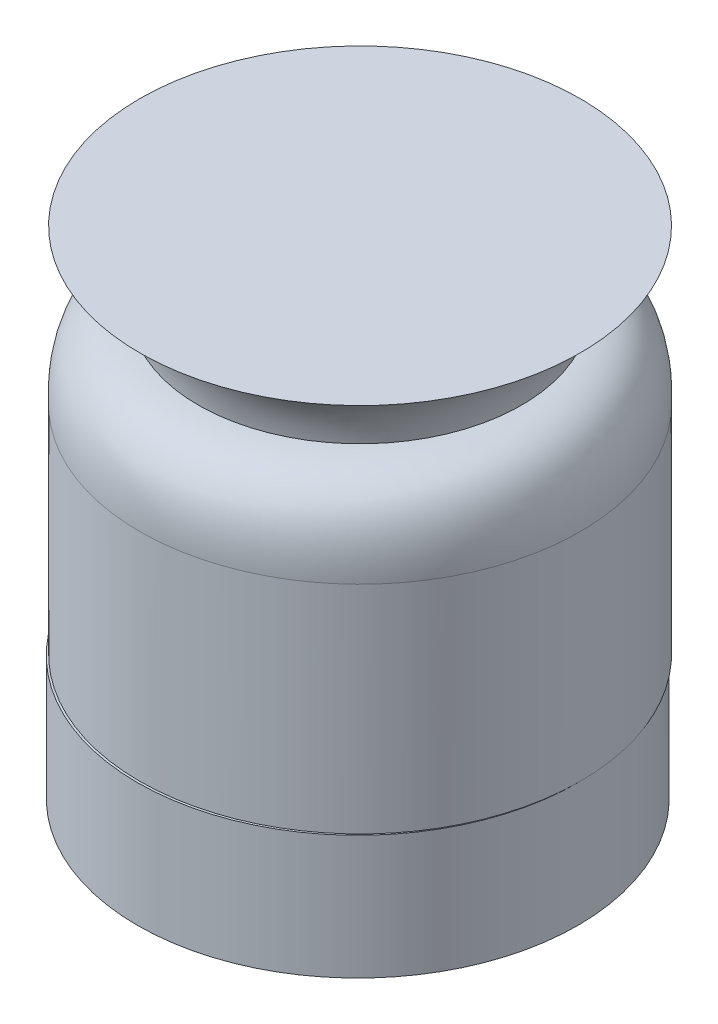
ISO-10303-21;
HEADER;
FILE_DESCRIPTION(('STEP AP214'),'2;1');
FILE_NAME('part.step','',(''),(''),'','','');
FILE_SCHEMA(('AUTOMOTIVE_DESIGN { 1 0 10303 214 1 1 1 1 }'));
ENDSEC;
DATA;
#1=APPLICATION_CONTEXT('core data for automotive mechanical design processes');
#2=APPLICATION_PROTOCOL_DEFINITION('international standard','automotive_design',2000,#1);
#3=PRODUCT_CONTEXT('',#1,'mechanical');
#4=PRODUCT('Part','Part','',(#3));
#5=PRODUCT_RELATED_PRODUCT_CATEGORY('part','',(#4));
#6=PRODUCT_DEFINITION_FORMATION('','',#4);
#7=PRODUCT_DEFINITION_CONTEXT('part definition',#1,'design');
#8=PRODUCT_DEFINITION('design','',#6,#7);
#9=PRODUCT_DEFINITION_SHAPE('','',#8);
#10=(LENGTH_UNIT() NAMED_UNIT(*) SI_UNIT(.MILLI.,.METRE.));
#11=(NAMED_UNIT(*) PLANE_ANGLE_UNIT() SI_UNIT($,.RADIAN.));
#12=(NAMED_UNIT(*) SI_UNIT($,.STERADIAN.) SOLID_ANGLE_UNIT());
#13=UNCERTAINTY_MEASURE_WITH_UNIT(LENGTH_MEASURE(1.E-05),#10,'distance_accuracy_value','');
#14=(GEOMETRIC_REPRESENTATION_CONTEXT(3) GLOBAL_UNCERTAINTY_ASSIGNED_CONTEXT((#13)) GLOBAL_UNIT_ASSIGNED_CONTEXT((#10,
#11,#12)) REPRESENTATION_CONTEXT('',''));
#15=CARTESIAN_POINT('',(0.,0.,0.));
#16=DIRECTION('',(0.,0.,1.));
#17=DIRECTION('',(1.,0.,0.));
#18=AXIS2_PLACEMENT_3D('',#15,#16,#17);
#19=CARTESIAN_POINT('',(-82.935,10.795,1.90500000000002));
#20=DIRECTION('',(0.,1.,0.));
#21=DIRECTION('',(0.,0.,1.));
#22=AXIS2_PLACEMENT_3D('',#19,#20,#21);
#23=PLANE('',#22);
#24=CARTESIAN_POINT('',(-37.975,10.7949999999999,-47.5));
#25=DIRECTION('',(0.,1.,0.));
#26=DIRECTION('',(-1.,0.,0.));
#27=AXIS2_PLACEMENT_3D('',#24,#25,#26);
#28=CIRCLE('',#27,47.5);
#29=CARTESIAN_POINT('',(-85.4743526520651,10.7949999999999,-47.2520128334827));
#30=VERTEX_POINT('',#29);
#31=CARTESIAN_POINT('',(9.52435265206508,10.7949999999999,-47.2520128334841));
#32=VERTEX_POINT('',#31);
#33=EDGE_CURVE('E76',#30,#32,#28,.T.);
#34=ORIENTED_EDGE('',*,*,#33,.F.);
#35=CARTESIAN_POINT('',(-37.975,10.7949999999999,-47.0040256669681));
#36=DIRECTION('',(0.,1.,0.));
#37=DIRECTION('',(0.,0.,1.));
#38=AXIS2_PLACEMENT_3D('',#35,#36,#37);
#39=CIRCLE('',#38,47.5);
#40=EDGE_CURVE('E70',#30,#32,#39,.T.);
#41=ORIENTED_EDGE('',*,*,#40,.T.);
#42=EDGE_LOOP('',(#34,#41));
#43=FACE_BOUND('',#42,.T.);
#44=ADVANCED_FACE('F61',(#43),#23,.T.);
#45=CARTESIAN_POINT('',(-82.935,-15.875,1.90500000000005));
#46=DIRECTION('',(0.,1.,0.));
#47=DIRECTION('',(0.,0.,1.));
#48=AXIS2_PLACEMENT_3D('',#45,#46,#47);
#49=PLANE('',#48);
#50=CARTESIAN_POINT('',(-37.975,-15.8750000000001,-47.0040256669681));
#51=DIRECTION('',(0.,1.,0.));
#52=DIRECTION('',(0.,0.,1.));
#53=AXIS2_PLACEMENT_3D('',#50,#51,#52);
#54=CIRCLE('',#53,47.5);
#55=CARTESIAN_POINT('',(-37.975,-15.875,0.49597433303189));
#56=VERTEX_POINT('',#55);
#57=EDGE_CURVE('E65',#56,#56,#54,.T.);
#58=ORIENTED_EDGE('',*,*,#57,.F.);
#59=EDGE_LOOP('',(#58));
#60=FACE_BOUND('',#59,.T.);
#61=ADVANCED_FACE('F108',(#60),#49,.F.);
#62=CARTESIAN_POINT('',(-37.975,10.7949999999999,-47.0040256669681));
#63=DIRECTION('',(0.,-1.,0.));
#64=DIRECTION('',(0.,0.,-1.));
#65=AXIS2_PLACEMENT_3D('',#62,#63,#64);
#66=CYLINDRICAL_SURFACE('',#65,47.5);
#67=ORIENTED_EDGE('',*,*,#57,.T.);
#68=EDGE_LOOP('',(#67));
#69=FACE_BOUND('',#68,.T.);
#70=EDGE_CURVE('E12',#32,#30,#39,.T.);
#71=ORIENTED_EDGE('',*,*,#70,.F.);
#72=ORIENTED_EDGE('',*,*,#40,.F.);
#73=EDGE_LOOP('',(#71,#72));
#74=FACE_BOUND('',#73,.T.);
#75=ADVANCED_FACE('F63',(#69,#74),#66,.T.);
#76=CARTESIAN_POINT('',(-37.975,10.7949999999999,-47.5));
#77=DIRECTION('',(0.,1.,0.));
#78=DIRECTION('',(-1.,0.,0.));
#79=AXIS2_PLACEMENT_3D('',#76,#77,#78);
#80=PLANE('',#79);
#81=EDGE_CURVE('E83',#32,#30,#28,.T.);
#82=ORIENTED_EDGE('',*,*,#81,.F.);
#83=ORIENTED_EDGE('',*,*,#70,.T.);
#84=EDGE_LOOP('',(#82,#83));
#85=FACE_BOUND('',#84,.T.);
#86=ADVANCED_FACE('F84',(#85),#80,.F.);
#87=CARTESIAN_POINT('',(9.52499999999998,90.7949999999999,-47.5));
#88=DIRECTION('',(0.,-1.,0.));
#89=DIRECTION('',(1.,0.,0.));
#90=AXIS2_PLACEMENT_3D('',#87,#88,#89);
#91=PLANE('',#90);
#92=CARTESIAN_POINT('',(-37.975,90.7949999999999,-47.5));
#93=DIRECTION('',(0.,1.,0.));
#94=DIRECTION('',(-1.,0.,0.));
#95=AXIS2_PLACEMENT_3D('',#92,#93,#94);
#96=CIRCLE('',#95,47.5);
#97=CARTESIAN_POINT('',(-85.4750000000001,90.7949999999999,-47.5));
#98=VERTEX_POINT('',#97);
#99=EDGE_CURVE('E100',#98,#98,#96,.T.);
#100=ORIENTED_EDGE('',*,*,#99,.T.);
#101=EDGE_LOOP('',(#100));
#102=FACE_BOUND('',#101,.T.);
#103=ADVANCED_FACE('F118',(#102),#91,.F.);
#104=CARTESIAN_POINT('',(-3.09815411187941,74.7348858850336,-47.5));
#105=CARTESIAN_POINT('',(-1.43623215643545,87.7641604837142,-47.5));
#106=CARTESIAN_POINT('',(9.52499999999998,90.7949999999999,-47.5));
#107=B_SPLINE_CURVE_WITH_KNOTS('',2,(#104,#105,#106),.UNSPECIFIED.,.F.,.F.,(3,3),(0.,1.),.UNSPECIFIED.);
#108=CARTESIAN_POINT('',(-37.975,10.7949999999999,-47.5));
#109=DIRECTION('',(0.,1.,0.));
#110=AXIS1_PLACEMENT('',#108,#109);
#111=SURFACE_OF_REVOLUTION('',#107,#110);
#112=ORIENTED_EDGE('',*,*,#99,.F.);
#113=EDGE_LOOP('',(#112));
#114=FACE_BOUND('',#113,.T.);
#115=CARTESIAN_POINT('',(-37.975,74.7348858850336,-47.5));
#116=DIRECTION('',(0.,1.,0.));
#117=DIRECTION('',(-1.,0.,0.));
#118=AXIS2_PLACEMENT_3D('',#115,#116,#117);
#119=CIRCLE('',#118,34.8768458881206);
#120=CARTESIAN_POINT('',(-72.8518458881206,74.7348858850336,-47.5));
#121=VERTEX_POINT('',#120);
#122=EDGE_CURVE('E90',#121,#121,#119,.T.);
#123=ORIENTED_EDGE('',*,*,#122,.T.);
#124=EDGE_LOOP('',(#123));
#125=FACE_BOUND('',#124,.T.);
#126=ADVANCED_FACE('F121',(#114,#125),#111,.T.);
#127=CARTESIAN_POINT('',(9.52499999999998,57.4269466490187,-47.5));
#128=CARTESIAN_POINT('',(10.2922524913205,74.361118407829,-47.5));
#129=CARTESIAN_POINT('',(-3.09815411187941,74.7348858850336,-47.5));
#130=B_SPLINE_CURVE_WITH_KNOTS('',2,(#127,#128,#129),.UNSPECIFIED.,.F.,.F.,(3,3),(0.,1.),.UNSPECIFIED.);
#131=CARTESIAN_POINT('',(-37.975,10.7949999999999,-47.5));
#132=DIRECTION('',(0.,1.,0.));
#133=AXIS1_PLACEMENT('',#131,#132);
#134=SURFACE_OF_REVOLUTION('',#130,#133);
#135=ORIENTED_EDGE('',*,*,#122,.F.);
#136=EDGE_LOOP('',(#135));
#137=FACE_BOUND('',#136,.T.);
#138=CARTESIAN_POINT('',(-37.975,57.4269466490187,-47.5));
#139=DIRECTION('',(0.,1.,0.));
#140=DIRECTION('',(-1.,0.,0.));
#141=AXIS2_PLACEMENT_3D('',#138,#139,#140);
#142=CIRCLE('',#141,47.5);
#143=CARTESIAN_POINT('',(-85.4750000000001,57.4269466490187,-47.5));
#144=VERTEX_POINT('',#143);
#145=EDGE_CURVE('E88',#144,#144,#142,.T.);
#146=ORIENTED_EDGE('',*,*,#145,.T.);
#147=EDGE_LOOP('',(#146));
#148=FACE_BOUND('',#147,.T.);
#149=ADVANCED_FACE('F124',(#137,#148),#134,.T.);
#150=CARTESIAN_POINT('',(-37.975,10.7949999999999,-47.5));
#151=DIRECTION('',(0.,1.,0.));
#152=DIRECTION('',(-1.,0.,0.));
#153=AXIS2_PLACEMENT_3D('',#150,#151,#152);
#154=CYLINDRICAL_SURFACE('',#153,47.5);
#155=ORIENTED_EDGE('',*,*,#145,.F.);
#156=EDGE_LOOP('',(#155));
#157=FACE_BOUND('',#156,.T.);
#158=ORIENTED_EDGE('',*,*,#33,.T.);
#159=ORIENTED_EDGE('',*,*,#81,.T.);
#160=EDGE_LOOP('',(#158,#159));
#161=FACE_BOUND('',#160,.T.);
#162=ADVANCED_FACE('F87',(#157,#161),#154,.T.);
#163=CLOSED_SHELL('',(#44,#61,#75,#86,#103,#126,#149,#162));
#164=MANIFOLD_SOLID_BREP('B2',#163);
#165=ADVANCED_BREP_SHAPE_REPRESENTATION('',(#18,#164),#14);
#166=SHAPE_DEFINITION_REPRESENTATION(#9,#165);
ENDSEC;
END-ISO-10303-21;
